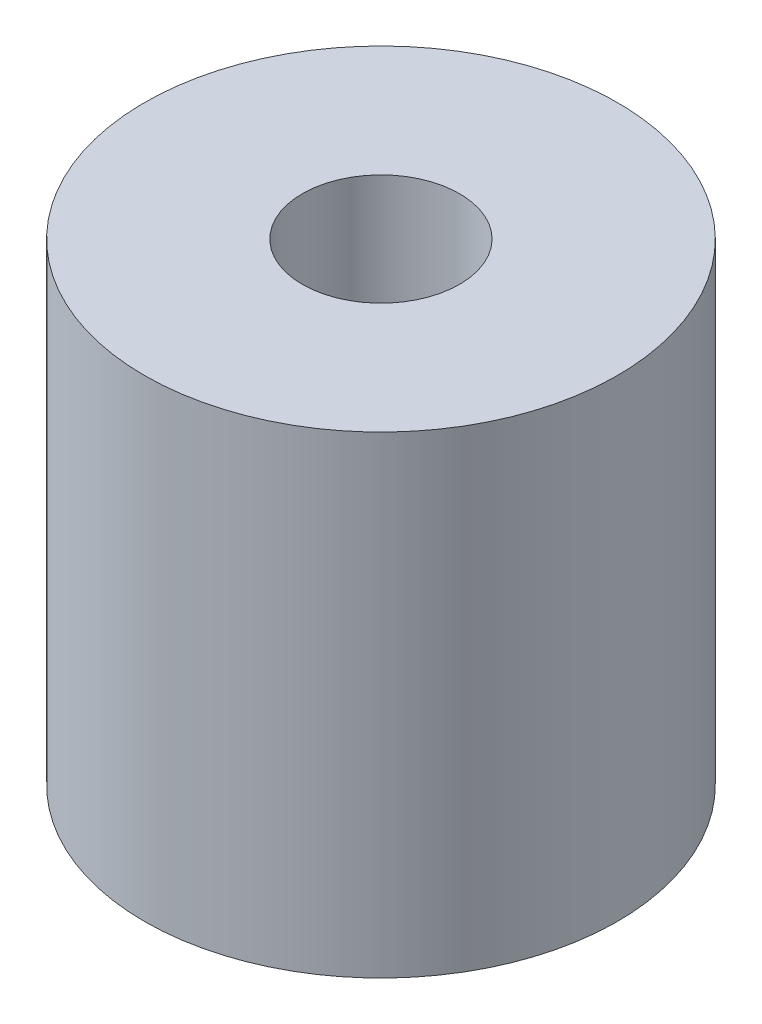
ISO-10303-21;
HEADER;
FILE_DESCRIPTION(('STEP AP214'),'2;1');
FILE_NAME('part.step','',(''),(''),'','','');
FILE_SCHEMA(('AUTOMOTIVE_DESIGN { 1 0 10303 214 1 1 1 1 }'));
ENDSEC;
DATA;
#1=APPLICATION_CONTEXT('core data for automotive mechanical design processes');
#2=APPLICATION_PROTOCOL_DEFINITION('international standard','automotive_design',2000,#1);
#3=PRODUCT_CONTEXT('',#1,'mechanical');
#4=PRODUCT('Part','Part','',(#3));
#5=PRODUCT_RELATED_PRODUCT_CATEGORY('part','',(#4));
#6=PRODUCT_DEFINITION_FORMATION('','',#4);
#7=PRODUCT_DEFINITION_CONTEXT('part definition',#1,'design');
#8=PRODUCT_DEFINITION('design','',#6,#7);
#9=PRODUCT_DEFINITION_SHAPE('','',#8);
#10=(LENGTH_UNIT() NAMED_UNIT(*) SI_UNIT(.MILLI.,.METRE.));
#11=(NAMED_UNIT(*) PLANE_ANGLE_UNIT() SI_UNIT($,.RADIAN.));
#12=(NAMED_UNIT(*) SI_UNIT($,.STERADIAN.) SOLID_ANGLE_UNIT());
#13=UNCERTAINTY_MEASURE_WITH_UNIT(LENGTH_MEASURE(1.E-05),#10,'distance_accuracy_value','');
#14=(GEOMETRIC_REPRESENTATION_CONTEXT(3) GLOBAL_UNCERTAINTY_ASSIGNED_CONTEXT((#13)) GLOBAL_UNIT_ASSIGNED_CONTEXT((#10,
#11,#12)) REPRESENTATION_CONTEXT('',''));
#15=CARTESIAN_POINT('',(0.,0.,0.));
#16=DIRECTION('',(0.,0.,1.));
#17=DIRECTION('',(1.,0.,0.));
#18=AXIS2_PLACEMENT_3D('',#15,#16,#17);
#19=CARTESIAN_POINT('',(0.,25.4,0.));
#20=DIRECTION('',(0.,1.,0.));
#21=DIRECTION('',(0.,0.,1.));
#22=AXIS2_PLACEMENT_3D('',#19,#20,#21);
#23=PLANE('',#22);
#24=CARTESIAN_POINT('',(0.,25.4,0.));
#25=DIRECTION('',(0.,1.,0.));
#26=DIRECTION('',(0.,0.,1.));
#27=AXIS2_PLACEMENT_3D('',#24,#25,#26);
#28=CIRCLE('',#27,12.7);
#29=CARTESIAN_POINT('',(0.,25.4,12.7));
#30=VERTEX_POINT('',#29);
#31=EDGE_CURVE('E10',#30,#30,#28,.T.);
#32=ORIENTED_EDGE('',*,*,#31,.T.);
#33=EDGE_LOOP('',(#32));
#34=FACE_BOUND('',#33,.T.);
#35=CARTESIAN_POINT('',(0.,25.4,0.));
#36=DIRECTION('',(0.,1.,0.));
#37=DIRECTION('',(0.,0.,1.));
#38=AXIS2_PLACEMENT_3D('',#35,#36,#37);
#39=CIRCLE('',#38,4.22275);
#40=CARTESIAN_POINT('',(0.,25.4,4.22275));
#41=VERTEX_POINT('',#40);
#42=EDGE_CURVE('E42',#41,#41,#39,.T.);
#43=ORIENTED_EDGE('',*,*,#42,.F.);
#44=EDGE_LOOP('',(#43));
#45=FACE_BOUND('',#44,.T.);
#46=ADVANCED_FACE('F31',(#34,#45),#23,.T.);
#47=CARTESIAN_POINT('',(0.,0.,0.));
#48=DIRECTION('',(0.,1.,0.));
#49=DIRECTION('',(0.,0.,1.));
#50=AXIS2_PLACEMENT_3D('',#47,#48,#49);
#51=PLANE('',#50);
#52=CARTESIAN_POINT('',(0.,0.,0.));
#53=DIRECTION('',(0.,1.,0.));
#54=DIRECTION('',(0.,0.,1.));
#55=AXIS2_PLACEMENT_3D('',#52,#53,#54);
#56=CIRCLE('',#55,12.7);
#57=CARTESIAN_POINT('',(0.,0.,12.7));
#58=VERTEX_POINT('',#57);
#59=EDGE_CURVE('E35',#58,#58,#56,.T.);
#60=ORIENTED_EDGE('',*,*,#59,.F.);
#61=EDGE_LOOP('',(#60));
#62=FACE_BOUND('',#61,.T.);
#63=CARTESIAN_POINT('',(0.,0.,0.));
#64=DIRECTION('',(0.,1.,0.));
#65=DIRECTION('',(0.,0.,1.));
#66=AXIS2_PLACEMENT_3D('',#63,#64,#65);
#67=CIRCLE('',#66,4.22275);
#68=CARTESIAN_POINT('',(0.,0.,4.22275));
#69=VERTEX_POINT('',#68);
#70=EDGE_CURVE('E44',#69,#69,#67,.T.);
#71=ORIENTED_EDGE('',*,*,#70,.T.);
#72=EDGE_LOOP('',(#71));
#73=FACE_BOUND('',#72,.T.);
#74=ADVANCED_FACE('F54',(#62,#73),#51,.F.);
#75=CARTESIAN_POINT('',(0.,25.4,0.));
#76=DIRECTION('',(0.,-1.,0.));
#77=DIRECTION('',(0.,0.,-1.));
#78=AXIS2_PLACEMENT_3D('',#75,#76,#77);
#79=CYLINDRICAL_SURFACE('',#78,12.7);
#80=ORIENTED_EDGE('',*,*,#31,.F.);
#81=EDGE_LOOP('',(#80));
#82=FACE_BOUND('',#81,.T.);
#83=ORIENTED_EDGE('',*,*,#59,.T.);
#84=EDGE_LOOP('',(#83));
#85=FACE_BOUND('',#84,.T.);
#86=ADVANCED_FACE('F33',(#82,#85),#79,.T.);
#87=CARTESIAN_POINT('',(0.,25.4,0.));
#88=DIRECTION('',(0.,-1.,0.));
#89=DIRECTION('',(0.,0.,-1.));
#90=AXIS2_PLACEMENT_3D('',#87,#88,#89);
#91=CYLINDRICAL_SURFACE('',#90,4.22275);
#92=ORIENTED_EDGE('',*,*,#42,.T.);
#93=EDGE_LOOP('',(#92));
#94=FACE_BOUND('',#93,.T.);
#95=ORIENTED_EDGE('',*,*,#70,.F.);
#96=EDGE_LOOP('',(#95));
#97=FACE_BOUND('',#96,.T.);
#98=ADVANCED_FACE('F50',(#94,#97),#91,.F.);
#99=CLOSED_SHELL('',(#46,#74,#86,#98));
#100=MANIFOLD_SOLID_BREP('B2',#99);
#101=ADVANCED_BREP_SHAPE_REPRESENTATION('',(#18,#100),#14);
#102=SHAPE_DEFINITION_REPRESENTATION(#9,#101);
ENDSEC;
END-ISO-10303-21;
